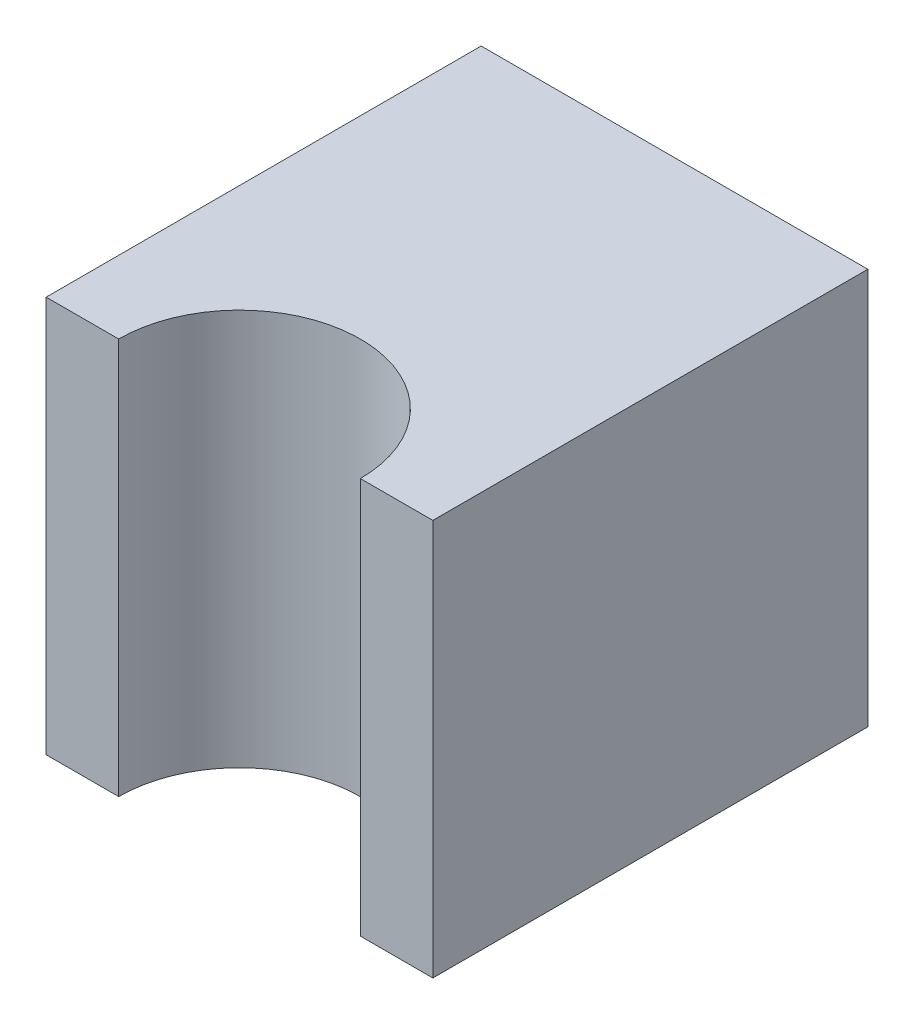
ISO-10303-21;
HEADER;
FILE_DESCRIPTION(('STEP AP214'),'2;1');
FILE_NAME('part.step','',(''),(''),'','','');
FILE_SCHEMA(('AUTOMOTIVE_DESIGN { 1 0 10303 214 1 1 1 1 }'));
ENDSEC;
DATA;
#1=APPLICATION_CONTEXT('core data for automotive mechanical design processes');
#2=APPLICATION_PROTOCOL_DEFINITION('international standard','automotive_design',2000,#1);
#3=PRODUCT_CONTEXT('',#1,'mechanical');
#4=PRODUCT('Part','Part','',(#3));
#5=PRODUCT_RELATED_PRODUCT_CATEGORY('part','',(#4));
#6=PRODUCT_DEFINITION_FORMATION('','',#4);
#7=PRODUCT_DEFINITION_CONTEXT('part definition',#1,'design');
#8=PRODUCT_DEFINITION('design','',#6,#7);
#9=PRODUCT_DEFINITION_SHAPE('','',#8);
#10=(LENGTH_UNIT() NAMED_UNIT(*) SI_UNIT(.MILLI.,.METRE.));
#11=(NAMED_UNIT(*) PLANE_ANGLE_UNIT() SI_UNIT($,.RADIAN.));
#12=(NAMED_UNIT(*) SI_UNIT($,.STERADIAN.) SOLID_ANGLE_UNIT());
#13=UNCERTAINTY_MEASURE_WITH_UNIT(LENGTH_MEASURE(1.E-05),#10,'distance_accuracy_value','');
#14=(GEOMETRIC_REPRESENTATION_CONTEXT(3) GLOBAL_UNCERTAINTY_ASSIGNED_CONTEXT((#13)) GLOBAL_UNIT_ASSIGNED_CONTEXT((#10,
#11,#12)) REPRESENTATION_CONTEXT('',''));
#15=CARTESIAN_POINT('',(0.,0.,0.));
#16=DIRECTION('',(0.,0.,1.));
#17=DIRECTION('',(1.,0.,0.));
#18=AXIS2_PLACEMENT_3D('',#15,#16,#17);
#19=CARTESIAN_POINT('',(2.85,0.,6.1));
#20=DIRECTION('',(0.,0.,1.));
#21=DIRECTION('',(1.,0.,0.));
#22=AXIS2_PLACEMENT_3D('',#19,#20,#21);
#23=PLANE('',#22);
#24=DIRECTION('',(1.,0.,0.));
#25=VECTOR('',#24,1.);
#26=CARTESIAN_POINT('',(2.6,0.82,6.1));
#27=LINE('',#26,#25);
#28=CARTESIAN_POINT('',(2.85,0.82,6.1));
#29=VERTEX_POINT('',#28);
#30=CARTESIAN_POINT('',(3.,0.82,6.1));
#31=VERTEX_POINT('',#30);
#32=EDGE_CURVE('E76',#29,#31,#27,.T.);
#33=ORIENTED_EDGE('',*,*,#32,.F.);
#34=DIRECTION('',(0.,1.,0.));
#35=VECTOR('',#34,1.);
#36=CARTESIAN_POINT('',(2.85,0.,6.1));
#37=LINE('',#36,#35);
#38=CARTESIAN_POINT('',(2.85,0.,6.1));
#39=VERTEX_POINT('',#38);
#40=EDGE_CURVE('E72',#29,#39,#37,.F.);
#41=ORIENTED_EDGE('',*,*,#40,.T.);
#42=DIRECTION('',(1.,0.,0.));
#43=VECTOR('',#42,1.);
#44=CARTESIAN_POINT('',(2.6,0.,6.1));
#45=LINE('',#44,#43);
#46=CARTESIAN_POINT('',(3.,0.,6.1));
#47=VERTEX_POINT('',#46);
#48=EDGE_CURVE('E73',#39,#47,#45,.T.);
#49=ORIENTED_EDGE('',*,*,#48,.T.);
#50=DIRECTION('',(0.,1.,0.));
#51=VECTOR('',#50,1.);
#52=CARTESIAN_POINT('',(3.,0.,6.1));
#53=LINE('',#52,#51);
#54=EDGE_CURVE('E80',#31,#47,#53,.F.);
#55=ORIENTED_EDGE('',*,*,#54,.F.);
#56=EDGE_LOOP('',(#33,#41,#49,#55));
#57=FACE_BOUND('',#56,.T.);
#58=ADVANCED_FACE('F17',(#57),#23,.T.);
#59=CARTESIAN_POINT('',(2.6,0.,6.1));
#60=DIRECTION('',(0.,1.,0.));
#61=DIRECTION('',(0.,0.,1.));
#62=AXIS2_PLACEMENT_3D('',#59,#60,#61);
#63=CYLINDRICAL_SURFACE('',#62,0.25);
#64=ORIENTED_EDGE('',*,*,#40,.F.);
#65=CARTESIAN_POINT('',(2.6,0.82,6.1));
#66=DIRECTION('',(0.,1.,0.));
#67=DIRECTION('',(0.,0.,1.));
#68=AXIS2_PLACEMENT_3D('',#65,#66,#67);
#69=CIRCLE('',#68,0.25);
#70=CARTESIAN_POINT('',(2.35,0.82,6.1));
#71=VERTEX_POINT('',#70);
#72=EDGE_CURVE('E129',#71,#29,#69,.F.);
#73=ORIENTED_EDGE('',*,*,#72,.F.);
#74=DIRECTION('',(0.,1.,0.));
#75=VECTOR('',#74,1.);
#76=CARTESIAN_POINT('',(2.35,0.,6.1));
#77=LINE('',#76,#75);
#78=CARTESIAN_POINT('',(2.35,0.,6.1));
#79=VERTEX_POINT('',#78);
#80=EDGE_CURVE('E83',#79,#71,#77,.T.);
#81=ORIENTED_EDGE('',*,*,#80,.F.);
#82=CARTESIAN_POINT('',(2.6,0.,6.1));
#83=DIRECTION('',(0.,1.,0.));
#84=DIRECTION('',(0.,0.,1.));
#85=AXIS2_PLACEMENT_3D('',#82,#83,#84);
#86=CIRCLE('',#85,0.25);
#87=EDGE_CURVE('E20',#79,#39,#86,.F.);
#88=ORIENTED_EDGE('',*,*,#87,.T.);
#89=EDGE_LOOP('',(#64,#73,#81,#88));
#90=FACE_BOUND('',#89,.T.);
#91=ADVANCED_FACE('F82',(#90),#63,.F.);
#92=CARTESIAN_POINT('',(3.,0.,6.1));
#93=DIRECTION('',(1.,0.,0.));
#94=DIRECTION('',(0.,0.,-1.));
#95=AXIS2_PLACEMENT_3D('',#92,#93,#94);
#96=PLANE('',#95);
#97=DIRECTION('',(0.,0.,1.));
#98=VECTOR('',#97,1.);
#99=CARTESIAN_POINT('',(3.,0.82,5.65));
#100=LINE('',#99,#98);
#101=CARTESIAN_POINT('',(3.,0.82,5.2));
#102=VERTEX_POINT('',#101);
#103=EDGE_CURVE('E108',#31,#102,#100,.F.);
#104=ORIENTED_EDGE('',*,*,#103,.F.);
#105=ORIENTED_EDGE('',*,*,#54,.T.);
#106=DIRECTION('',(0.,0.,1.));
#107=VECTOR('',#106,1.);
#108=CARTESIAN_POINT('',(3.,0.,5.65));
#109=LINE('',#108,#107);
#110=CARTESIAN_POINT('',(3.,0.,5.2));
#111=VERTEX_POINT('',#110);
#112=EDGE_CURVE('E85',#47,#111,#109,.F.);
#113=ORIENTED_EDGE('',*,*,#112,.T.);
#114=DIRECTION('',(0.,1.,0.));
#115=VECTOR('',#114,1.);
#116=CARTESIAN_POINT('',(3.,0.,5.2));
#117=LINE('',#116,#115);
#118=EDGE_CURVE('E120',#102,#111,#117,.F.);
#119=ORIENTED_EDGE('',*,*,#118,.F.);
#120=EDGE_LOOP('',(#104,#105,#113,#119));
#121=FACE_BOUND('',#120,.T.);
#122=ADVANCED_FACE('F144',(#121),#96,.T.);
#123=CARTESIAN_POINT('',(2.6,0.,5.65));
#124=DIRECTION('',(0.,1.,0.));
#125=DIRECTION('',(0.,0.,1.));
#126=AXIS2_PLACEMENT_3D('',#123,#124,#125);
#127=PLANE('',#126);
#128=ORIENTED_EDGE('',*,*,#87,.F.);
#129=DIRECTION('',(1.,0.,0.));
#130=VECTOR('',#129,1.);
#131=CARTESIAN_POINT('',(2.2,0.,6.1));
#132=LINE('',#131,#130);
#133=CARTESIAN_POINT('',(2.2,0.,6.1));
#134=VERTEX_POINT('',#133);
#135=EDGE_CURVE('E88',#134,#79,#132,.T.);
#136=ORIENTED_EDGE('',*,*,#135,.F.);
#137=DIRECTION('',(0.,0.,1.));
#138=VECTOR('',#137,1.);
#139=CARTESIAN_POINT('',(2.2,0.,5.2));
#140=LINE('',#139,#138);
#141=CARTESIAN_POINT('',(2.2,0.,5.2));
#142=VERTEX_POINT('',#141);
#143=EDGE_CURVE('E105',#142,#134,#140,.T.);
#144=ORIENTED_EDGE('',*,*,#143,.F.);
#145=DIRECTION('',(-1.,0.,0.));
#146=VECTOR('',#145,1.);
#147=CARTESIAN_POINT('',(3.,0.,5.2));
#148=LINE('',#147,#146);
#149=EDGE_CURVE('E126',#111,#142,#148,.T.);
#150=ORIENTED_EDGE('',*,*,#149,.F.);
#151=ORIENTED_EDGE('',*,*,#112,.F.);
#152=ORIENTED_EDGE('',*,*,#48,.F.);
#153=EDGE_LOOP('',(#128,#136,#144,#150,#151,#152));
#154=FACE_BOUND('',#153,.T.);
#155=ADVANCED_FACE('F86',(#154),#127,.F.);
#156=CARTESIAN_POINT('',(2.2,0.,6.1));
#157=DIRECTION('',(0.,0.,1.));
#158=DIRECTION('',(1.,0.,0.));
#159=AXIS2_PLACEMENT_3D('',#156,#157,#158);
#160=PLANE('',#159);
#161=DIRECTION('',(1.,0.,0.));
#162=VECTOR('',#161,1.);
#163=CARTESIAN_POINT('',(2.6,0.82,6.1));
#164=LINE('',#163,#162);
#165=CARTESIAN_POINT('',(2.2,0.82,6.1));
#166=VERTEX_POINT('',#165);
#167=EDGE_CURVE('E110',#166,#71,#164,.T.);
#168=ORIENTED_EDGE('',*,*,#167,.F.);
#169=DIRECTION('',(0.,1.,0.));
#170=VECTOR('',#169,1.);
#171=CARTESIAN_POINT('',(2.2,0.,6.1));
#172=LINE('',#171,#170);
#173=EDGE_CURVE('E100',#134,#166,#172,.T.);
#174=ORIENTED_EDGE('',*,*,#173,.F.);
#175=ORIENTED_EDGE('',*,*,#135,.T.);
#176=ORIENTED_EDGE('',*,*,#80,.T.);
#177=EDGE_LOOP('',(#168,#174,#175,#176));
#178=FACE_BOUND('',#177,.T.);
#179=ADVANCED_FACE('F151',(#178),#160,.T.);
#180=CARTESIAN_POINT('',(2.6,0.82,5.65));
#181=DIRECTION('',(0.,1.,0.));
#182=DIRECTION('',(0.,0.,1.));
#183=AXIS2_PLACEMENT_3D('',#180,#181,#182);
#184=PLANE('',#183);
#185=ORIENTED_EDGE('',*,*,#167,.T.);
#186=ORIENTED_EDGE('',*,*,#72,.T.);
#187=ORIENTED_EDGE('',*,*,#32,.T.);
#188=ORIENTED_EDGE('',*,*,#103,.T.);
#189=DIRECTION('',(-1.,0.,0.));
#190=VECTOR('',#189,1.);
#191=CARTESIAN_POINT('',(3.,0.82,5.2));
#192=LINE('',#191,#190);
#193=CARTESIAN_POINT('',(2.2,0.82,5.2));
#194=VERTEX_POINT('',#193);
#195=EDGE_CURVE('E35',#194,#102,#192,.F.);
#196=ORIENTED_EDGE('',*,*,#195,.F.);
#197=DIRECTION('',(0.,0.,1.));
#198=VECTOR('',#197,1.);
#199=CARTESIAN_POINT('',(2.2,0.82,5.2));
#200=LINE('',#199,#198);
#201=EDGE_CURVE('E26',#166,#194,#200,.F.);
#202=ORIENTED_EDGE('',*,*,#201,.F.);
#203=EDGE_LOOP('',(#185,#186,#187,#188,#196,#202));
#204=FACE_BOUND('',#203,.T.);
#205=ADVANCED_FACE('F140',(#204),#184,.T.);
#206=CARTESIAN_POINT('',(3.,0.,5.2));
#207=DIRECTION('',(0.,0.,-1.));
#208=DIRECTION('',(-1.,0.,0.));
#209=AXIS2_PLACEMENT_3D('',#206,#207,#208);
#210=PLANE('',#209);
#211=ORIENTED_EDGE('',*,*,#195,.T.);
#212=ORIENTED_EDGE('',*,*,#118,.T.);
#213=ORIENTED_EDGE('',*,*,#149,.T.);
#214=DIRECTION('',(0.,1.,0.));
#215=VECTOR('',#214,1.);
#216=CARTESIAN_POINT('',(2.2,0.,5.2));
#217=LINE('',#216,#215);
#218=EDGE_CURVE('E11',#194,#142,#217,.F.);
#219=ORIENTED_EDGE('',*,*,#218,.F.);
#220=EDGE_LOOP('',(#211,#212,#213,#219));
#221=FACE_BOUND('',#220,.T.);
#222=ADVANCED_FACE('F146',(#221),#210,.T.);
#223=CARTESIAN_POINT('',(2.2,0.,5.2));
#224=DIRECTION('',(-1.,0.,0.));
#225=DIRECTION('',(0.,0.,1.));
#226=AXIS2_PLACEMENT_3D('',#223,#224,#225);
#227=PLANE('',#226);
#228=ORIENTED_EDGE('',*,*,#201,.T.);
#229=ORIENTED_EDGE('',*,*,#218,.T.);
#230=ORIENTED_EDGE('',*,*,#143,.T.);
#231=ORIENTED_EDGE('',*,*,#173,.T.);
#232=EDGE_LOOP('',(#228,#229,#230,#231));
#233=FACE_BOUND('',#232,.T.);
#234=ADVANCED_FACE('F148',(#233),#227,.T.);
#235=CLOSED_SHELL('',(#58,#91,#122,#155,#179,#205,#222,#234));
#236=MANIFOLD_SOLID_BREP('B1',#235);
#237=ADVANCED_BREP_SHAPE_REPRESENTATION('',(#18,#236),#14);
#238=SHAPE_DEFINITION_REPRESENTATION(#9,#237);
ENDSEC;
END-ISO-10303-21;
